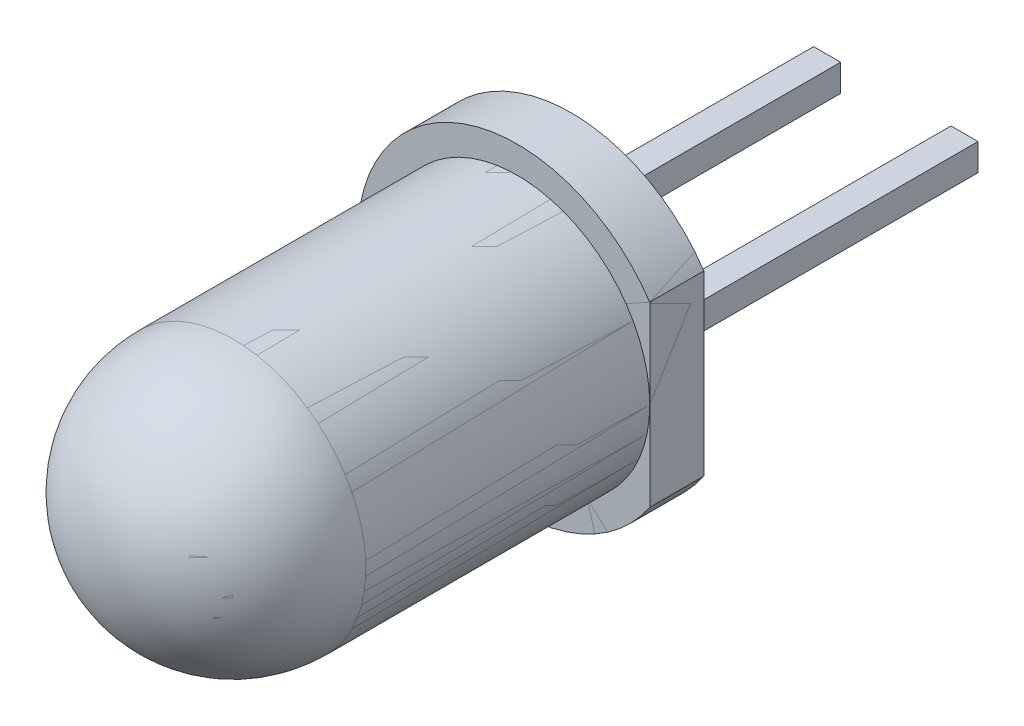
ISO-10303-21;
HEADER;
FILE_DESCRIPTION(('STEP AP214'),'2;1');
FILE_NAME('part.step','',(''),(''),'','','');
FILE_SCHEMA(('AUTOMOTIVE_DESIGN { 1 0 10303 214 1 1 1 1 }'));
ENDSEC;
DATA;
#1=APPLICATION_CONTEXT('core data for automotive mechanical design processes');
#2=APPLICATION_PROTOCOL_DEFINITION('international standard','automotive_design',2000,#1);
#3=PRODUCT_CONTEXT('',#1,'mechanical');
#4=PRODUCT('Part','Part','',(#3));
#5=PRODUCT_RELATED_PRODUCT_CATEGORY('part','',(#4));
#6=PRODUCT_DEFINITION_FORMATION('','',#4);
#7=PRODUCT_DEFINITION_CONTEXT('part definition',#1,'design');
#8=PRODUCT_DEFINITION('design','',#6,#7);
#9=PRODUCT_DEFINITION_SHAPE('','',#8);
#10=(LENGTH_UNIT() NAMED_UNIT(*) SI_UNIT(.MILLI.,.METRE.));
#11=(NAMED_UNIT(*) PLANE_ANGLE_UNIT() SI_UNIT($,.RADIAN.));
#12=(NAMED_UNIT(*) SI_UNIT($,.STERADIAN.) SOLID_ANGLE_UNIT());
#13=UNCERTAINTY_MEASURE_WITH_UNIT(LENGTH_MEASURE(1.E-05),#10,'distance_accuracy_value','');
#14=(GEOMETRIC_REPRESENTATION_CONTEXT(3) GLOBAL_UNCERTAINTY_ASSIGNED_CONTEXT((#13)) GLOBAL_UNIT_ASSIGNED_CONTEXT((#10,
#11,#12)) REPRESENTATION_CONTEXT('',''));
#15=CARTESIAN_POINT('',(0.,0.,0.));
#16=DIRECTION('',(0.,0.,1.));
#17=DIRECTION('',(1.,0.,0.));
#18=AXIS2_PLACEMENT_3D('',#15,#16,#17);
#19=CARTESIAN_POINT('',(0.,0.,3.));
#20=DIRECTION('',(0.,0.,1.));
#21=DIRECTION('',(1.,0.,0.));
#22=AXIS2_PLACEMENT_3D('',#19,#20,#21);
#23=PLANE('',#22);
#24=CARTESIAN_POINT('',(0.,0.,3.));
#25=DIRECTION('',(0.,0.,1.));
#26=DIRECTION('',(-1.,0.,0.));
#27=AXIS2_PLACEMENT_3D('',#24,#25,#26);
#28=CIRCLE('',#27,2.95);
#29=CARTESIAN_POINT('',(-2.95,0.,3.));
#30=VERTEX_POINT('',#29);
#31=CARTESIAN_POINT('',(2.45,-1.643167672515,3.));
#32=VERTEX_POINT('',#31);
#33=EDGE_CURVE('P0_E26',#30,#32,#28,.T.);
#34=ORIENTED_EDGE('',*,*,#33,.F.);
#35=CARTESIAN_POINT('',(0.,0.,3.));
#36=DIRECTION('',(0.,0.,1.));
#37=DIRECTION('',(-1.,0.,0.));
#38=AXIS2_PLACEMENT_3D('',#35,#36,#37);
#39=CIRCLE('',#38,2.95);
#40=CARTESIAN_POINT('',(2.45,1.643167672515,3.));
#41=VERTEX_POINT('',#40);
#42=EDGE_CURVE('P0_E40',#41,#30,#39,.T.);
#43=ORIENTED_EDGE('',*,*,#42,.F.);
#44=DIRECTION('',(0.,-1.,0.));
#45=VECTOR('',#44,1.);
#46=CARTESIAN_POINT('',(2.45,1.643167672515,3.));
#47=LINE('',#46,#45);
#48=EDGE_CURVE('P0_E11',#41,#32,#47,.T.);
#49=ORIENTED_EDGE('',*,*,#48,.T.);
#50=EDGE_LOOP('',(#34,#43,#49));
#51=FACE_BOUND('',#50,.T.);
#52=ADVANCED_FACE('P0_F16',(#51),#23,.F.);
#53=CARTESIAN_POINT('',(0.,0.,3.));
#54=DIRECTION('',(0.,0.,1.));
#55=DIRECTION('',(-1.,0.,0.));
#56=AXIS2_PLACEMENT_3D('',#53,#54,#55);
#57=CYLINDRICAL_SURFACE('',#56,2.95);
#58=DIRECTION('',(0.,0.,1.));
#59=VECTOR('',#58,1.);
#60=CARTESIAN_POINT('',(-2.95,0.,3.));
#61=LINE('',#60,#59);
#62=CARTESIAN_POINT('',(-2.95,0.,4.));
#63=VERTEX_POINT('',#62);
#64=EDGE_CURVE('P0_E113',#30,#63,#61,.T.);
#65=ORIENTED_EDGE('',*,*,#64,.F.);
#66=ORIENTED_EDGE('',*,*,#33,.T.);
#67=DIRECTION('',(0.,0.,1.));
#68=VECTOR('',#67,1.);
#69=CARTESIAN_POINT('',(2.45,-1.643167672515,3.));
#70=LINE('',#69,#68);
#71=CARTESIAN_POINT('',(2.45,-1.643167672516,4.));
#72=VERTEX_POINT('',#71);
#73=EDGE_CURVE('P0_E103',#32,#72,#70,.T.);
#74=ORIENTED_EDGE('',*,*,#73,.T.);
#75=CARTESIAN_POINT('',(0.,0.,4.));
#76=DIRECTION('',(0.,0.,1.));
#77=DIRECTION('',(-1.,0.,0.));
#78=AXIS2_PLACEMENT_3D('',#75,#76,#77);
#79=CIRCLE('',#78,2.95);
#80=EDGE_CURVE('P0_E19',#63,#72,#79,.T.);
#81=ORIENTED_EDGE('',*,*,#80,.F.);
#82=EDGE_LOOP('',(#65,#66,#74,#81));
#83=FACE_BOUND('',#82,.T.);
#84=ADVANCED_FACE('P0_F148',(#83),#57,.T.);
#85=CARTESIAN_POINT('',(2.45,1.643167672515,3.));
#86=DIRECTION('',(1.,0.,0.));
#87=DIRECTION('',(0.,1.,0.));
#88=AXIS2_PLACEMENT_3D('',#85,#86,#87);
#89=PLANE('',#88);
#90=ORIENTED_EDGE('',*,*,#48,.F.);
#91=DIRECTION('',(0.,0.,1.));
#92=VECTOR('',#91,1.);
#93=CARTESIAN_POINT('',(2.45,1.643167672515,3.));
#94=LINE('',#93,#92);
#95=CARTESIAN_POINT('',(2.45,1.643167672516,4.));
#96=VERTEX_POINT('',#95);
#97=EDGE_CURVE('P0_E101',#41,#96,#94,.T.);
#98=ORIENTED_EDGE('',*,*,#97,.T.);
#99=DIRECTION('',(0.,1.,0.));
#100=VECTOR('',#99,1.);
#101=CARTESIAN_POINT('',(2.45,0.821583836258,4.));
#102=LINE('',#101,#100);
#103=CARTESIAN_POINT('',(2.45,9.424321810697E-08,4.));
#104=VERTEX_POINT('',#103);
#105=EDGE_CURVE('P0_E69',#104,#96,#102,.T.);
#106=ORIENTED_EDGE('',*,*,#105,.F.);
#107=DIRECTION('',(0.,1.,0.));
#108=VECTOR('',#107,1.);
#109=CARTESIAN_POINT('',(2.45,0.821583836258,4.));
#110=LINE('',#109,#108);
#111=EDGE_CURVE('P0_E123',#72,#104,#110,.T.);
#112=ORIENTED_EDGE('',*,*,#111,.F.);
#113=ORIENTED_EDGE('',*,*,#73,.F.);
#114=EDGE_LOOP('',(#90,#98,#106,#112,#113));
#115=FACE_BOUND('',#114,.T.);
#116=ADVANCED_FACE('P0_F142',(#115),#89,.T.);
#117=CARTESIAN_POINT('',(0.,0.,3.));
#118=DIRECTION('',(0.,0.,1.));
#119=DIRECTION('',(-1.,0.,0.));
#120=AXIS2_PLACEMENT_3D('',#117,#118,#119);
#121=CYLINDRICAL_SURFACE('',#120,2.95);
#122=ORIENTED_EDGE('',*,*,#42,.T.);
#123=ORIENTED_EDGE('',*,*,#64,.T.);
#124=CARTESIAN_POINT('',(0.,0.,4.));
#125=DIRECTION('',(0.,0.,1.));
#126=DIRECTION('',(-1.,0.,0.));
#127=AXIS2_PLACEMENT_3D('',#124,#125,#126);
#128=CIRCLE('',#127,2.95);
#129=EDGE_CURVE('P0_E118',#96,#63,#128,.T.);
#130=ORIENTED_EDGE('',*,*,#129,.F.);
#131=ORIENTED_EDGE('',*,*,#97,.F.);
#132=EDGE_LOOP('',(#122,#123,#130,#131));
#133=FACE_BOUND('',#132,.T.);
#134=ADVANCED_FACE('P0_F158',(#133),#121,.T.);
#135=CARTESIAN_POINT('',(0.,0.,4.));
#136=DIRECTION('',(0.,0.,1.));
#137=DIRECTION('',(1.,0.,0.));
#138=AXIS2_PLACEMENT_3D('',#135,#136,#137);
#139=PLANE('',#138);
#140=ORIENTED_EDGE('',*,*,#129,.T.);
#141=ORIENTED_EDGE('',*,*,#80,.T.);
#142=ORIENTED_EDGE('',*,*,#111,.T.);
#143=CARTESIAN_POINT('',(0.,0.,4.));
#144=DIRECTION('',(0.,0.,1.));
#145=DIRECTION('',(-1.,0.,0.));
#146=AXIS2_PLACEMENT_3D('',#143,#144,#145);
#147=CIRCLE('',#146,2.45);
#148=CARTESIAN_POINT('',(-2.45,0.,4.));
#149=VERTEX_POINT('',#148);
#150=EDGE_CURVE('P0_E80',#149,#104,#147,.T.);
#151=ORIENTED_EDGE('',*,*,#150,.F.);
#152=CARTESIAN_POINT('',(0.,0.,4.));
#153=DIRECTION('',(0.,0.,1.));
#154=DIRECTION('',(-1.,0.,0.));
#155=AXIS2_PLACEMENT_3D('',#152,#153,#154);
#156=CIRCLE('',#155,2.45);
#157=EDGE_CURVE('P0_E99',#104,#149,#156,.T.);
#158=ORIENTED_EDGE('',*,*,#157,.F.);
#159=ORIENTED_EDGE('',*,*,#105,.T.);
#160=EDGE_LOOP('',(#140,#141,#142,#151,#158,#159));
#161=FACE_BOUND('',#160,.T.);
#162=ADVANCED_FACE('P0_F138',(#161),#139,.T.);
#163=CARTESIAN_POINT('',(0.,0.,4.));
#164=DIRECTION('',(0.,0.,1.));
#165=DIRECTION('',(-1.,0.,0.));
#166=AXIS2_PLACEMENT_3D('',#163,#164,#165);
#167=CYLINDRICAL_SURFACE('',#166,2.45);
#168=DIRECTION('',(0.,0.,1.));
#169=VECTOR('',#168,1.);
#170=CARTESIAN_POINT('',(-2.45,0.,4.));
#171=LINE('',#170,#169);
#172=CARTESIAN_POINT('',(-2.45,0.,9.25));
#173=VERTEX_POINT('',#172);
#174=EDGE_CURVE('P0_E87',#149,#173,#171,.T.);
#175=ORIENTED_EDGE('',*,*,#174,.F.);
#176=ORIENTED_EDGE('',*,*,#150,.T.);
#177=ORIENTED_EDGE('',*,*,#157,.T.);
#178=ORIENTED_EDGE('',*,*,#174,.T.);
#179=CARTESIAN_POINT('',(0.,0.,9.25));
#180=DIRECTION('',(0.,0.,1.));
#181=DIRECTION('',(-1.,0.,0.));
#182=AXIS2_PLACEMENT_3D('',#179,#180,#181);
#183=CIRCLE('',#182,2.45);
#184=EDGE_CURVE('P0_E85',#173,#173,#183,.T.);
#185=ORIENTED_EDGE('',*,*,#184,.F.);
#186=EDGE_LOOP('',(#175,#176,#177,#178,#185));
#187=FACE_BOUND('',#186,.T.);
#188=ADVANCED_FACE('P0_F86',(#187),#167,.T.);
#189=CARTESIAN_POINT('',(0.,0.,9.25));
#190=DIRECTION('',(0.,0.,-1.));
#191=DIRECTION('',(-1.,0.,0.));
#192=AXIS2_PLACEMENT_3D('',#189,#190,#191);
#193=SPHERICAL_SURFACE('',#192,2.45);
#194=CARTESIAN_POINT('',(0.,0.,9.25));
#195=DIRECTION('',(0.,-1.,0.));
#196=DIRECTION('',(1.,0.,0.));
#197=AXIS2_PLACEMENT_3D('',#194,#195,#196);
#198=CIRCLE('',#197,2.45);
#199=CARTESIAN_POINT('',(0.,0.,11.7));
#200=VERTEX_POINT('',#199);
#201=EDGE_CURVE('P0_E91',#200,#173,#198,.T.);
#202=ORIENTED_EDGE('',*,*,#201,.T.);
#203=ORIENTED_EDGE('',*,*,#184,.T.);
#204=ORIENTED_EDGE('',*,*,#201,.F.);
#205=EDGE_LOOP('',(#202,#203,#204));
#206=FACE_BOUND('',#205,.T.);
#207=ADVANCED_FACE('P0_F161',(#206),#193,.T.);
#208=CLOSED_SHELL('',(#52,#84,#116,#134,#162,#188,#207));
#209=MANIFOLD_SOLID_BREP('P0_B1',#208);
#210=CARTESIAN_POINT('',(-1.02,0.25,3.));
#211=DIRECTION('',(0.,1.,0.));
#212=DIRECTION('',(1.,0.,0.));
#213=AXIS2_PLACEMENT_3D('',#210,#211,#212);
#214=PLANE('',#213);
#215=DIRECTION('',(0.,0.,-1.));
#216=VECTOR('',#215,1.);
#217=CARTESIAN_POINT('',(-1.02,0.25,3.));
#218=LINE('',#217,#216);
#219=CARTESIAN_POINT('',(-1.02,0.25,3.));
#220=VERTEX_POINT('',#219);
#221=CARTESIAN_POINT('',(-1.02,0.25,-3.));
#222=VERTEX_POINT('',#221);
#223=EDGE_CURVE('P1_E11',#220,#222,#218,.T.);
#224=ORIENTED_EDGE('',*,*,#223,.T.);
#225=DIRECTION('',(-1.,0.,0.));
#226=VECTOR('',#225,1.);
#227=CARTESIAN_POINT('',(-1.02,0.25,-3.));
#228=LINE('',#227,#226);
#229=CARTESIAN_POINT('',(-1.52,0.25,-3.));
#230=VERTEX_POINT('',#229);
#231=EDGE_CURVE('P1_E25',#222,#230,#228,.T.);
#232=ORIENTED_EDGE('',*,*,#231,.T.);
#233=DIRECTION('',(0.,0.,-1.));
#234=VECTOR('',#233,1.);
#235=CARTESIAN_POINT('',(-1.52,0.25,3.));
#236=LINE('',#235,#234);
#237=CARTESIAN_POINT('',(-1.52,0.25,3.));
#238=VERTEX_POINT('',#237);
#239=EDGE_CURVE('P1_E48',#238,#230,#236,.T.);
#240=ORIENTED_EDGE('',*,*,#239,.F.);
#241=DIRECTION('',(-1.,0.,0.));
#242=VECTOR('',#241,1.);
#243=CARTESIAN_POINT('',(-1.02,0.25,3.));
#244=LINE('',#243,#242);
#245=EDGE_CURVE('P1_E92',#220,#238,#244,.T.);
#246=ORIENTED_EDGE('',*,*,#245,.F.);
#247=EDGE_LOOP('',(#224,#232,#240,#246));
#248=FACE_BOUND('',#247,.T.);
#249=ADVANCED_FACE('P1_F16',(#248),#214,.T.);
#250=CARTESIAN_POINT('',(-1.52,0.25,3.));
#251=DIRECTION('',(-1.,0.,0.));
#252=DIRECTION('',(0.,0.,1.));
#253=AXIS2_PLACEMENT_3D('',#250,#251,#252);
#254=PLANE('',#253);
#255=ORIENTED_EDGE('',*,*,#239,.T.);
#256=DIRECTION('',(0.,-1.,0.));
#257=VECTOR('',#256,1.);
#258=CARTESIAN_POINT('',(-1.52,0.25,-3.));
#259=LINE('',#258,#257);
#260=CARTESIAN_POINT('',(-1.52,-0.25,-3.));
#261=VERTEX_POINT('',#260);
#262=EDGE_CURVE('P1_E105',#230,#261,#259,.T.);
#263=ORIENTED_EDGE('',*,*,#262,.T.);
#264=DIRECTION('',(0.,0.,-1.));
#265=VECTOR('',#264,1.);
#266=CARTESIAN_POINT('',(-1.52,-0.25,3.));
#267=LINE('',#266,#265);
#268=CARTESIAN_POINT('',(-1.52,-0.25,3.));
#269=VERTEX_POINT('',#268);
#270=EDGE_CURVE('P1_E87',#269,#261,#267,.T.);
#271=ORIENTED_EDGE('',*,*,#270,.F.);
#272=DIRECTION('',(0.,-1.,0.));
#273=VECTOR('',#272,1.);
#274=CARTESIAN_POINT('',(-1.52,0.25,3.));
#275=LINE('',#274,#273);
#276=EDGE_CURVE('P1_E98',#238,#269,#275,.T.);
#277=ORIENTED_EDGE('',*,*,#276,.F.);
#278=EDGE_LOOP('',(#255,#263,#271,#277));
#279=FACE_BOUND('',#278,.T.);
#280=ADVANCED_FACE('P1_F18',(#279),#254,.T.);
#281=CARTESIAN_POINT('',(-1.52,-0.25,3.));
#282=DIRECTION('',(0.,-1.,0.));
#283=DIRECTION('',(0.,0.,-1.));
#284=AXIS2_PLACEMENT_3D('',#281,#282,#283);
#285=PLANE('',#284);
#286=ORIENTED_EDGE('',*,*,#270,.T.);
#287=DIRECTION('',(1.,0.,0.));
#288=VECTOR('',#287,1.);
#289=CARTESIAN_POINT('',(-1.52,-0.25,-3.));
#290=LINE('',#289,#288);
#291=CARTESIAN_POINT('',(-1.02,-0.25,-3.));
#292=VERTEX_POINT('',#291);
#293=EDGE_CURVE('P1_E82',#261,#292,#290,.T.);
#294=ORIENTED_EDGE('',*,*,#293,.T.);
#295=DIRECTION('',(0.,0.,-1.));
#296=VECTOR('',#295,1.);
#297=CARTESIAN_POINT('',(-1.02,-0.25,3.));
#298=LINE('',#297,#296);
#299=CARTESIAN_POINT('',(-1.02,-0.25,3.));
#300=VERTEX_POINT('',#299);
#301=EDGE_CURVE('P1_E72',#300,#292,#298,.T.);
#302=ORIENTED_EDGE('',*,*,#301,.F.);
#303=DIRECTION('',(1.,0.,0.));
#304=VECTOR('',#303,1.);
#305=CARTESIAN_POINT('',(-1.52,-0.25,3.));
#306=LINE('',#305,#304);
#307=EDGE_CURVE('P1_E108',#269,#300,#306,.T.);
#308=ORIENTED_EDGE('',*,*,#307,.F.);
#309=EDGE_LOOP('',(#286,#294,#302,#308));
#310=FACE_BOUND('',#309,.T.);
#311=ADVANCED_FACE('P1_F85',(#310),#285,.T.);
#312=CARTESIAN_POINT('',(-1.02,-0.25,3.));
#313=DIRECTION('',(1.,0.,0.));
#314=DIRECTION('',(0.,1.,0.));
#315=AXIS2_PLACEMENT_3D('',#312,#313,#314);
#316=PLANE('',#315);
#317=ORIENTED_EDGE('',*,*,#301,.T.);
#318=DIRECTION('',(0.,1.,0.));
#319=VECTOR('',#318,1.);
#320=CARTESIAN_POINT('',(-1.02,-0.25,-3.));
#321=LINE('',#320,#319);
#322=EDGE_CURVE('P1_E76',#292,#222,#321,.T.);
#323=ORIENTED_EDGE('',*,*,#322,.T.);
#324=ORIENTED_EDGE('',*,*,#223,.F.);
#325=DIRECTION('',(0.,1.,0.));
#326=VECTOR('',#325,1.);
#327=CARTESIAN_POINT('',(-1.02,-0.25,3.));
#328=LINE('',#327,#326);
#329=EDGE_CURVE('P1_E78',#300,#220,#328,.T.);
#330=ORIENTED_EDGE('',*,*,#329,.F.);
#331=EDGE_LOOP('',(#317,#323,#324,#330));
#332=FACE_BOUND('',#331,.T.);
#333=ADVANCED_FACE('P1_F74',(#332),#316,.T.);
#334=CARTESIAN_POINT('',(-1.27,-2.2737E-13,3.));
#335=DIRECTION('',(0.,0.,1.));
#336=DIRECTION('',(1.,0.,0.));
#337=AXIS2_PLACEMENT_3D('',#334,#335,#336);
#338=PLANE('',#337);
#339=ORIENTED_EDGE('',*,*,#245,.T.);
#340=ORIENTED_EDGE('',*,*,#276,.T.);
#341=ORIENTED_EDGE('',*,*,#307,.T.);
#342=ORIENTED_EDGE('',*,*,#329,.T.);
#343=EDGE_LOOP('',(#339,#340,#341,#342));
#344=FACE_BOUND('',#343,.T.);
#345=ADVANCED_FACE('P1_F167',(#344),#338,.T.);
#346=CARTESIAN_POINT('',(-1.27,-2.2737E-13,-3.));
#347=DIRECTION('',(0.,0.,1.));
#348=DIRECTION('',(1.,0.,0.));
#349=AXIS2_PLACEMENT_3D('',#346,#347,#348);
#350=PLANE('',#349);
#351=ORIENTED_EDGE('',*,*,#322,.F.);
#352=ORIENTED_EDGE('',*,*,#293,.F.);
#353=ORIENTED_EDGE('',*,*,#262,.F.);
#354=ORIENTED_EDGE('',*,*,#231,.F.);
#355=EDGE_LOOP('',(#351,#352,#353,#354));
#356=FACE_BOUND('',#355,.T.);
#357=ADVANCED_FACE('P1_F90',(#356),#350,.F.);
#358=CLOSED_SHELL('',(#249,#280,#311,#333,#345,#357));
#359=MANIFOLD_SOLID_BREP('P1_B1',#358);
#360=CARTESIAN_POINT('',(1.52,0.25,3.));
#361=DIRECTION('',(0.,1.,0.));
#362=DIRECTION('',(1.,0.,0.));
#363=AXIS2_PLACEMENT_3D('',#360,#361,#362);
#364=PLANE('',#363);
#365=DIRECTION('',(0.,0.,-1.));
#366=VECTOR('',#365,1.);
#367=CARTESIAN_POINT('',(1.52,0.25,3.));
#368=LINE('',#367,#366);
#369=CARTESIAN_POINT('',(1.52,0.25,3.));
#370=VERTEX_POINT('',#369);
#371=CARTESIAN_POINT('',(1.52,0.25,-3.));
#372=VERTEX_POINT('',#371);
#373=EDGE_CURVE('P2_E11',#370,#372,#368,.T.);
#374=ORIENTED_EDGE('',*,*,#373,.T.);
#375=DIRECTION('',(-1.,0.,0.));
#376=VECTOR('',#375,1.);
#377=CARTESIAN_POINT('',(1.52,0.25,-3.));
#378=LINE('',#377,#376);
#379=CARTESIAN_POINT('',(1.02,0.25,-3.));
#380=VERTEX_POINT('',#379);
#381=EDGE_CURVE('P2_E27',#372,#380,#378,.T.);
#382=ORIENTED_EDGE('',*,*,#381,.T.);
#383=DIRECTION('',(0.,0.,-1.));
#384=VECTOR('',#383,1.);
#385=CARTESIAN_POINT('',(1.02,0.25,3.));
#386=LINE('',#385,#384);
#387=CARTESIAN_POINT('',(1.02,0.25,3.));
#388=VERTEX_POINT('',#387);
#389=EDGE_CURVE('P2_E104',#388,#380,#386,.T.);
#390=ORIENTED_EDGE('',*,*,#389,.F.);
#391=DIRECTION('',(-1.,0.,0.));
#392=VECTOR('',#391,1.);
#393=CARTESIAN_POINT('',(1.52,0.25,3.));
#394=LINE('',#393,#392);
#395=EDGE_CURVE('P2_E109',#370,#388,#394,.T.);
#396=ORIENTED_EDGE('',*,*,#395,.F.);
#397=EDGE_LOOP('',(#374,#382,#390,#396));
#398=FACE_BOUND('',#397,.T.);
#399=ADVANCED_FACE('P2_F16',(#398),#364,.T.);
#400=CARTESIAN_POINT('',(1.02,0.25,3.));
#401=DIRECTION('',(-1.,0.,0.));
#402=DIRECTION('',(0.,0.,1.));
#403=AXIS2_PLACEMENT_3D('',#400,#401,#402);
#404=PLANE('',#403);
#405=ORIENTED_EDGE('',*,*,#389,.T.);
#406=DIRECTION('',(0.,-1.,0.));
#407=VECTOR('',#406,1.);
#408=CARTESIAN_POINT('',(1.02,0.25,-3.));
#409=LINE('',#408,#407);
#410=CARTESIAN_POINT('',(1.02,-0.25,-3.));
#411=VERTEX_POINT('',#410);
#412=EDGE_CURVE('P2_E98',#380,#411,#409,.T.);
#413=ORIENTED_EDGE('',*,*,#412,.T.);
#414=DIRECTION('',(0.,0.,-1.));
#415=VECTOR('',#414,1.);
#416=CARTESIAN_POINT('',(1.02,-0.25,3.));
#417=LINE('',#416,#415);
#418=CARTESIAN_POINT('',(1.02,-0.25,3.));
#419=VERTEX_POINT('',#418);
#420=EDGE_CURVE('P2_E94',#419,#411,#417,.T.);
#421=ORIENTED_EDGE('',*,*,#420,.F.);
#422=DIRECTION('',(0.,-1.,0.));
#423=VECTOR('',#422,1.);
#424=CARTESIAN_POINT('',(1.02,0.25,3.));
#425=LINE('',#424,#423);
#426=EDGE_CURVE('P2_E69',#388,#419,#425,.T.);
#427=ORIENTED_EDGE('',*,*,#426,.F.);
#428=EDGE_LOOP('',(#405,#413,#421,#427));
#429=FACE_BOUND('',#428,.T.);
#430=ADVANCED_FACE('P2_F18',(#429),#404,.T.);
#431=CARTESIAN_POINT('',(1.02,-0.25,3.));
#432=DIRECTION('',(0.,-1.,0.));
#433=DIRECTION('',(0.,0.,-1.));
#434=AXIS2_PLACEMENT_3D('',#431,#432,#433);
#435=PLANE('',#434);
#436=ORIENTED_EDGE('',*,*,#420,.T.);
#437=DIRECTION('',(1.,0.,0.));
#438=VECTOR('',#437,1.);
#439=CARTESIAN_POINT('',(1.02,-0.25,-3.));
#440=LINE('',#439,#438);
#441=CARTESIAN_POINT('',(1.52,-0.25,-3.));
#442=VERTEX_POINT('',#441);
#443=EDGE_CURVE('P2_E77',#411,#442,#440,.T.);
#444=ORIENTED_EDGE('',*,*,#443,.T.);
#445=DIRECTION('',(0.,0.,-1.));
#446=VECTOR('',#445,1.);
#447=CARTESIAN_POINT('',(1.52,-0.25,3.));
#448=LINE('',#447,#446);
#449=CARTESIAN_POINT('',(1.52,-0.25,3.));
#450=VERTEX_POINT('',#449);
#451=EDGE_CURVE('P2_E74',#450,#442,#448,.T.);
#452=ORIENTED_EDGE('',*,*,#451,.F.);
#453=DIRECTION('',(1.,0.,0.));
#454=VECTOR('',#453,1.);
#455=CARTESIAN_POINT('',(1.02,-0.25,3.));
#456=LINE('',#455,#454);
#457=EDGE_CURVE('P2_E20',#419,#450,#456,.T.);
#458=ORIENTED_EDGE('',*,*,#457,.F.);
#459=EDGE_LOOP('',(#436,#444,#452,#458));
#460=FACE_BOUND('',#459,.T.);
#461=ADVANCED_FACE('P2_F75',(#460),#435,.T.);
#462=CARTESIAN_POINT('',(1.52,-0.25,3.));
#463=DIRECTION('',(1.,0.,0.));
#464=DIRECTION('',(0.,1.,0.));
#465=AXIS2_PLACEMENT_3D('',#462,#463,#464);
#466=PLANE('',#465);
#467=ORIENTED_EDGE('',*,*,#451,.T.);
#468=DIRECTION('',(0.,1.,0.));
#469=VECTOR('',#468,1.);
#470=CARTESIAN_POINT('',(1.52,-0.25,-3.));
#471=LINE('',#470,#469);
#472=EDGE_CURVE('P2_E81',#442,#372,#471,.T.);
#473=ORIENTED_EDGE('',*,*,#472,.T.);
#474=ORIENTED_EDGE('',*,*,#373,.F.);
#475=DIRECTION('',(0.,1.,0.));
#476=VECTOR('',#475,1.);
#477=CARTESIAN_POINT('',(1.52,-0.25,3.));
#478=LINE('',#477,#476);
#479=EDGE_CURVE('P2_E67',#450,#370,#478,.T.);
#480=ORIENTED_EDGE('',*,*,#479,.F.);
#481=EDGE_LOOP('',(#467,#473,#474,#480));
#482=FACE_BOUND('',#481,.T.);
#483=ADVANCED_FACE('P2_F84',(#482),#466,.T.);
#484=CARTESIAN_POINT('',(1.27,-2.2737E-13,3.));
#485=DIRECTION('',(0.,0.,1.));
#486=DIRECTION('',(1.,0.,0.));
#487=AXIS2_PLACEMENT_3D('',#484,#485,#486);
#488=PLANE('',#487);
#489=ORIENTED_EDGE('',*,*,#395,.T.);
#490=ORIENTED_EDGE('',*,*,#426,.T.);
#491=ORIENTED_EDGE('',*,*,#457,.T.);
#492=ORIENTED_EDGE('',*,*,#479,.T.);
#493=EDGE_LOOP('',(#489,#490,#491,#492));
#494=FACE_BOUND('',#493,.T.);
#495=ADVANCED_FACE('P2_F65',(#494),#488,.T.);
#496=CARTESIAN_POINT('',(1.27,-2.2737E-13,-3.));
#497=DIRECTION('',(0.,0.,1.));
#498=DIRECTION('',(1.,0.,0.));
#499=AXIS2_PLACEMENT_3D('',#496,#497,#498);
#500=PLANE('',#499);
#501=ORIENTED_EDGE('',*,*,#472,.F.);
#502=ORIENTED_EDGE('',*,*,#443,.F.);
#503=ORIENTED_EDGE('',*,*,#412,.F.);
#504=ORIENTED_EDGE('',*,*,#381,.F.);
#505=EDGE_LOOP('',(#501,#502,#503,#504));
#506=FACE_BOUND('',#505,.T.);
#507=ADVANCED_FACE('P2_F152',(#506),#500,.F.);
#508=CLOSED_SHELL('',(#399,#430,#461,#483,#495,#507));
#509=MANIFOLD_SOLID_BREP('P2_B1',#508);
#510=CARTESIAN_POINT('',(0.,0.,3.));
#511=DIRECTION('',(0.,0.,1.));
#512=DIRECTION('',(1.,0.,0.));
#513=AXIS2_PLACEMENT_3D('',#510,#511,#512);
#514=PLANE('',#513);
#515=CARTESIAN_POINT('',(0.,0.,3.));
#516=DIRECTION('',(0.,0.,1.));
#517=DIRECTION('',(-1.,0.,0.));
#518=AXIS2_PLACEMENT_3D('',#515,#516,#517);
#519=CIRCLE('',#518,2.95);
#520=CARTESIAN_POINT('',(-2.95,0.,3.));
#521=VERTEX_POINT('',#520);
#522=CARTESIAN_POINT('',(2.45,-1.643167672515,3.));
#523=VERTEX_POINT('',#522);
#524=EDGE_CURVE('P3_E27',#521,#523,#519,.T.);
#525=ORIENTED_EDGE('',*,*,#524,.F.);
#526=CARTESIAN_POINT('',(0.,0.,3.));
#527=DIRECTION('',(0.,0.,1.));
#528=DIRECTION('',(-1.,0.,0.));
#529=AXIS2_PLACEMENT_3D('',#526,#527,#528);
#530=CIRCLE('',#529,2.95);
#531=CARTESIAN_POINT('',(2.45,1.643167672515,3.));
#532=VERTEX_POINT('',#531);
#533=EDGE_CURVE('P3_E41',#532,#521,#530,.T.);
#534=ORIENTED_EDGE('',*,*,#533,.F.);
#535=DIRECTION('',(0.,-1.,0.));
#536=VECTOR('',#535,1.);
#537=CARTESIAN_POINT('',(2.45,1.643167672515,3.));
#538=LINE('',#537,#536);
#539=EDGE_CURVE('P3_E11',#532,#523,#538,.T.);
#540=ORIENTED_EDGE('',*,*,#539,.T.);
#541=EDGE_LOOP('',(#525,#534,#540));
#542=FACE_BOUND('',#541,.T.);
#543=ADVANCED_FACE('P3_F16',(#542),#514,.F.);
#544=CARTESIAN_POINT('',(0.,0.,3.));
#545=DIRECTION('',(0.,0.,1.));
#546=DIRECTION('',(-1.,0.,0.));
#547=AXIS2_PLACEMENT_3D('',#544,#545,#546);
#548=CYLINDRICAL_SURFACE('',#547,2.95);
#549=DIRECTION('',(0.,0.,1.));
#550=VECTOR('',#549,1.);
#551=CARTESIAN_POINT('',(-2.95,0.,3.));
#552=LINE('',#551,#550);
#553=CARTESIAN_POINT('',(-2.95,0.,4.));
#554=VERTEX_POINT('',#553);
#555=EDGE_CURVE('P3_E110',#521,#554,#552,.T.);
#556=ORIENTED_EDGE('',*,*,#555,.F.);
#557=ORIENTED_EDGE('',*,*,#524,.T.);
#558=DIRECTION('',(0.,0.,1.));
#559=VECTOR('',#558,1.);
#560=CARTESIAN_POINT('',(2.45,-1.643167672515,3.));
#561=LINE('',#560,#559);
#562=CARTESIAN_POINT('',(2.45,-1.643167672516,4.));
#563=VERTEX_POINT('',#562);
#564=EDGE_CURVE('P3_E124',#523,#563,#561,.T.);
#565=ORIENTED_EDGE('',*,*,#564,.T.);
#566=CARTESIAN_POINT('',(0.,0.,4.));
#567=DIRECTION('',(0.,0.,1.));
#568=DIRECTION('',(-1.,0.,0.));
#569=AXIS2_PLACEMENT_3D('',#566,#567,#568);
#570=CIRCLE('',#569,2.95);
#571=EDGE_CURVE('P3_E65',#554,#563,#570,.T.);
#572=ORIENTED_EDGE('',*,*,#571,.F.);
#573=EDGE_LOOP('',(#556,#557,#565,#572));
#574=FACE_BOUND('',#573,.T.);
#575=ADVANCED_FACE('P3_F142',(#574),#548,.T.);
#576=CARTESIAN_POINT('',(2.45,1.643167672515,3.));
#577=DIRECTION('',(1.,0.,0.));
#578=DIRECTION('',(0.,1.,0.));
#579=AXIS2_PLACEMENT_3D('',#576,#577,#578);
#580=PLANE('',#579);
#581=ORIENTED_EDGE('',*,*,#539,.F.);
#582=DIRECTION('',(0.,0.,1.));
#583=VECTOR('',#582,1.);
#584=CARTESIAN_POINT('',(2.45,1.643167672515,3.));
#585=LINE('',#584,#583);
#586=CARTESIAN_POINT('',(2.45,1.643167672516,4.));
#587=VERTEX_POINT('',#586);
#588=EDGE_CURVE('P3_E109',#532,#587,#585,.T.);
#589=ORIENTED_EDGE('',*,*,#588,.T.);
#590=DIRECTION('',(0.,1.,0.));
#591=VECTOR('',#590,1.);
#592=CARTESIAN_POINT('',(2.45,0.821583836258,4.));
#593=LINE('',#592,#591);
#594=CARTESIAN_POINT('',(2.45,9.424321810697E-08,4.));
#595=VERTEX_POINT('',#594);
#596=EDGE_CURVE('P3_E102',#595,#587,#593,.T.);
#597=ORIENTED_EDGE('',*,*,#596,.F.);
#598=DIRECTION('',(0.,1.,0.));
#599=VECTOR('',#598,1.);
#600=CARTESIAN_POINT('',(2.45,0.821583836258,4.));
#601=LINE('',#600,#599);
#602=EDGE_CURVE('P3_E105',#563,#595,#601,.T.);
#603=ORIENTED_EDGE('',*,*,#602,.F.);
#604=ORIENTED_EDGE('',*,*,#564,.F.);
#605=EDGE_LOOP('',(#581,#589,#597,#603,#604));
#606=FACE_BOUND('',#605,.T.);
#607=ADVANCED_FACE('P3_F138',(#606),#580,.T.);
#608=CARTESIAN_POINT('',(0.,0.,3.));
#609=DIRECTION('',(0.,0.,1.));
#610=DIRECTION('',(-1.,0.,0.));
#611=AXIS2_PLACEMENT_3D('',#608,#609,#610);
#612=CYLINDRICAL_SURFACE('',#611,2.95);
#613=ORIENTED_EDGE('',*,*,#533,.T.);
#614=ORIENTED_EDGE('',*,*,#555,.T.);
#615=CARTESIAN_POINT('',(0.,0.,4.));
#616=DIRECTION('',(0.,0.,1.));
#617=DIRECTION('',(-1.,0.,0.));
#618=AXIS2_PLACEMENT_3D('',#615,#616,#617);
#619=CIRCLE('',#618,2.95);
#620=EDGE_CURVE('P3_E111',#587,#554,#619,.T.);
#621=ORIENTED_EDGE('',*,*,#620,.F.);
#622=ORIENTED_EDGE('',*,*,#588,.F.);
#623=EDGE_LOOP('',(#613,#614,#621,#622));
#624=FACE_BOUND('',#623,.T.);
#625=ADVANCED_FACE('P3_F141',(#624),#612,.T.);
#626=CARTESIAN_POINT('',(0.,0.,4.));
#627=DIRECTION('',(0.,0.,1.));
#628=DIRECTION('',(1.,0.,0.));
#629=AXIS2_PLACEMENT_3D('',#626,#627,#628);
#630=PLANE('',#629);
#631=ORIENTED_EDGE('',*,*,#620,.T.);
#632=ORIENTED_EDGE('',*,*,#571,.T.);
#633=ORIENTED_EDGE('',*,*,#602,.T.);
#634=CARTESIAN_POINT('',(0.,0.,4.));
#635=DIRECTION('',(0.,0.,1.));
#636=DIRECTION('',(-1.,0.,0.));
#637=AXIS2_PLACEMENT_3D('',#634,#635,#636);
#638=CIRCLE('',#637,2.45);
#639=CARTESIAN_POINT('',(-2.45,0.,4.));
#640=VERTEX_POINT('',#639);
#641=EDGE_CURVE('P3_E106',#640,#595,#638,.T.);
#642=ORIENTED_EDGE('',*,*,#641,.F.);
#643=CARTESIAN_POINT('',(0.,0.,4.));
#644=DIRECTION('',(0.,0.,1.));
#645=DIRECTION('',(-1.,0.,0.));
#646=AXIS2_PLACEMENT_3D('',#643,#644,#645);
#647=CIRCLE('',#646,2.45);
#648=EDGE_CURVE('P3_E84',#595,#640,#647,.T.);
#649=ORIENTED_EDGE('',*,*,#648,.F.);
#650=ORIENTED_EDGE('',*,*,#596,.T.);
#651=EDGE_LOOP('',(#631,#632,#633,#642,#649,#650));
#652=FACE_BOUND('',#651,.T.);
#653=ADVANCED_FACE('P3_F18',(#652),#630,.T.);
#654=CARTESIAN_POINT('',(0.,0.,4.));
#655=DIRECTION('',(0.,0.,1.));
#656=DIRECTION('',(-1.,0.,0.));
#657=AXIS2_PLACEMENT_3D('',#654,#655,#656);
#658=CYLINDRICAL_SURFACE('',#657,2.45);
#659=DIRECTION('',(0.,0.,1.));
#660=VECTOR('',#659,1.);
#661=CARTESIAN_POINT('',(-2.45,0.,4.));
#662=LINE('',#661,#660);
#663=CARTESIAN_POINT('',(-2.45,0.,9.25));
#664=VERTEX_POINT('',#663);
#665=EDGE_CURVE('P3_E92',#640,#664,#662,.T.);
#666=ORIENTED_EDGE('',*,*,#665,.F.);
#667=ORIENTED_EDGE('',*,*,#641,.T.);
#668=ORIENTED_EDGE('',*,*,#648,.T.);
#669=ORIENTED_EDGE('',*,*,#665,.T.);
#670=CARTESIAN_POINT('',(0.,0.,9.25));
#671=DIRECTION('',(0.,0.,1.));
#672=DIRECTION('',(-1.,0.,0.));
#673=AXIS2_PLACEMENT_3D('',#670,#671,#672);
#674=CIRCLE('',#673,2.45);
#675=EDGE_CURVE('P3_E90',#664,#664,#674,.T.);
#676=ORIENTED_EDGE('',*,*,#675,.F.);
#677=EDGE_LOOP('',(#666,#667,#668,#669,#676));
#678=FACE_BOUND('',#677,.T.);
#679=ADVANCED_FACE('P3_F91',(#678),#658,.T.);
#680=CARTESIAN_POINT('',(0.,0.,9.25));
#681=DIRECTION('',(0.,0.,-1.));
#682=DIRECTION('',(-1.,0.,0.));
#683=AXIS2_PLACEMENT_3D('',#680,#681,#682);
#684=SPHERICAL_SURFACE('',#683,2.45);
#685=CARTESIAN_POINT('',(0.,0.,9.25));
#686=DIRECTION('',(0.,-1.,0.));
#687=DIRECTION('',(1.,0.,0.));
#688=AXIS2_PLACEMENT_3D('',#685,#686,#687);
#689=CIRCLE('',#688,2.45);
#690=CARTESIAN_POINT('',(0.,0.,11.7));
#691=VERTEX_POINT('',#690);
#692=EDGE_CURVE('P3_E20',#691,#664,#689,.T.);
#693=ORIENTED_EDGE('',*,*,#692,.T.);
#694=ORIENTED_EDGE('',*,*,#675,.T.);
#695=ORIENTED_EDGE('',*,*,#692,.F.);
#696=EDGE_LOOP('',(#693,#694,#695));
#697=FACE_BOUND('',#696,.T.);
#698=ADVANCED_FACE('P3_F152',(#697),#684,.T.);
#699=CLOSED_SHELL('',(#543,#575,#607,#625,#653,#679,#698));
#700=MANIFOLD_SOLID_BREP('P3_B1',#699);
#701=ADVANCED_BREP_SHAPE_REPRESENTATION('',(#18,#209,#359,#509,#700),#14);
#702=SHAPE_DEFINITION_REPRESENTATION(#9,#701);
ENDSEC;
END-ISO-10303-21;
